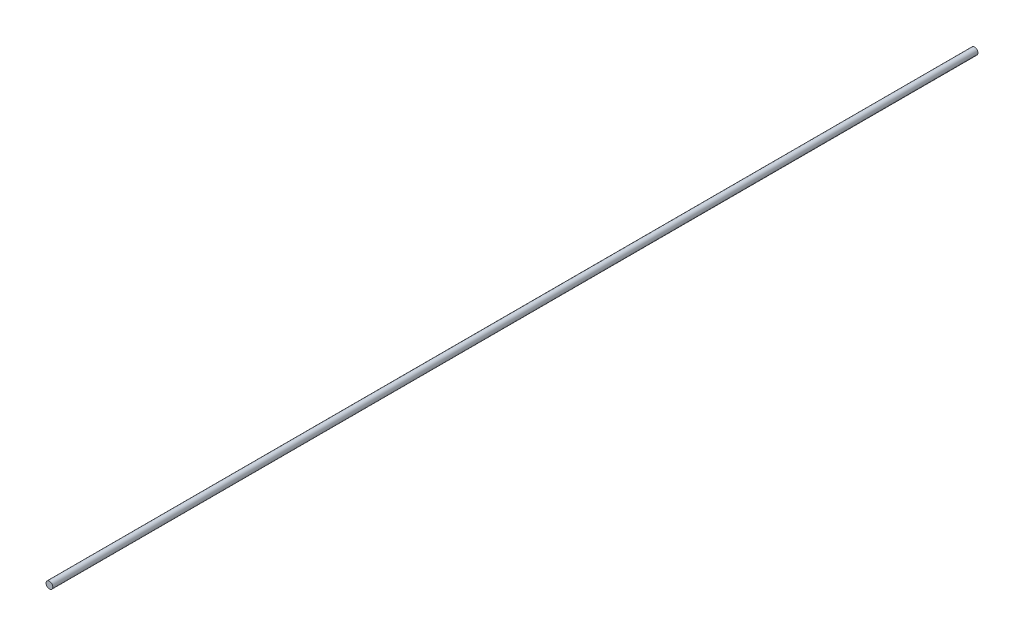
ISO-10303-21;
HEADER;
FILE_DESCRIPTION(('STEP AP214'),'2;1');
FILE_NAME('part.step','',(''),(''),'','','');
FILE_SCHEMA(('AUTOMOTIVE_DESIGN { 1 0 10303 214 1 1 1 1 }'));
ENDSEC;
DATA;
#1=APPLICATION_CONTEXT('core data for automotive mechanical design processes');
#2=APPLICATION_PROTOCOL_DEFINITION('international standard','automotive_design',2000,#1);
#3=PRODUCT_CONTEXT('',#1,'mechanical');
#4=PRODUCT('Part','Part','',(#3));
#5=PRODUCT_RELATED_PRODUCT_CATEGORY('part','',(#4));
#6=PRODUCT_DEFINITION_FORMATION('','',#4);
#7=PRODUCT_DEFINITION_CONTEXT('part definition',#1,'design');
#8=PRODUCT_DEFINITION('design','',#6,#7);
#9=PRODUCT_DEFINITION_SHAPE('','',#8);
#10=(LENGTH_UNIT() NAMED_UNIT(*) SI_UNIT(.MILLI.,.METRE.));
#11=(NAMED_UNIT(*) PLANE_ANGLE_UNIT() SI_UNIT($,.RADIAN.));
#12=(NAMED_UNIT(*) SI_UNIT($,.STERADIAN.) SOLID_ANGLE_UNIT());
#13=UNCERTAINTY_MEASURE_WITH_UNIT(LENGTH_MEASURE(1.E-05),#10,'distance_accuracy_value','');
#14=(GEOMETRIC_REPRESENTATION_CONTEXT(3) GLOBAL_UNCERTAINTY_ASSIGNED_CONTEXT((#13)) GLOBAL_UNIT_ASSIGNED_CONTEXT((#10,
#11,#12)) REPRESENTATION_CONTEXT('',''));
#15=CARTESIAN_POINT('',(0.,0.,0.));
#16=DIRECTION('',(0.,0.,1.));
#17=DIRECTION('',(1.,0.,0.));
#18=AXIS2_PLACEMENT_3D('',#15,#16,#17);
#19=CARTESIAN_POINT('',(0.,0.,863.6));
#20=DIRECTION('',(0.,0.,-1.));
#21=DIRECTION('',(-1.,0.,0.));
#22=AXIS2_PLACEMENT_3D('',#19,#20,#21);
#23=CYLINDRICAL_SURFACE('',#22,6.35);
#24=CARTESIAN_POINT('',(0.,0.,863.6));
#25=DIRECTION('',(0.,0.,1.));
#26=DIRECTION('',(1.,0.,0.));
#27=AXIS2_PLACEMENT_3D('',#24,#25,#26);
#28=CIRCLE('',#27,6.35);
#29=CARTESIAN_POINT('',(6.35,0.,863.6));
#30=VERTEX_POINT('',#29);
#31=EDGE_CURVE('E10',#30,#30,#28,.T.);
#32=ORIENTED_EDGE('',*,*,#31,.F.);
#33=EDGE_LOOP('',(#32));
#34=FACE_BOUND('',#33,.T.);
#35=CARTESIAN_POINT('',(0.,0.,-863.6));
#36=DIRECTION('',(0.,0.,1.));
#37=DIRECTION('',(1.,0.,0.));
#38=AXIS2_PLACEMENT_3D('',#35,#36,#37);
#39=CIRCLE('',#38,6.35);
#40=CARTESIAN_POINT('',(6.35,0.,-863.6));
#41=VERTEX_POINT('',#40);
#42=EDGE_CURVE('E46',#41,#41,#39,.T.);
#43=ORIENTED_EDGE('',*,*,#42,.T.);
#44=EDGE_LOOP('',(#43));
#45=FACE_BOUND('',#44,.T.);
#46=ADVANCED_FACE('F43',(#34,#45),#23,.T.);
#47=CARTESIAN_POINT('',(0.,0.,863.6));
#48=DIRECTION('',(0.,0.,1.));
#49=DIRECTION('',(1.,0.,0.));
#50=AXIS2_PLACEMENT_3D('',#47,#48,#49);
#51=PLANE('',#50);
#52=ORIENTED_EDGE('',*,*,#31,.T.);
#53=EDGE_LOOP('',(#52));
#54=FACE_BOUND('',#53,.T.);
#55=ADVANCED_FACE('F60',(#54),#51,.T.);
#56=CARTESIAN_POINT('',(0.,0.,-863.6));
#57=DIRECTION('',(0.,0.,1.));
#58=DIRECTION('',(1.,0.,0.));
#59=AXIS2_PLACEMENT_3D('',#56,#57,#58);
#60=PLANE('',#59);
#61=ORIENTED_EDGE('',*,*,#42,.F.);
#62=EDGE_LOOP('',(#61));
#63=FACE_BOUND('',#62,.T.);
#64=ADVANCED_FACE('F58',(#63),#60,.F.);
#65=CLOSED_SHELL('',(#46,#55,#64));
#66=MANIFOLD_SOLID_BREP('B2',#65);
#67=ADVANCED_BREP_SHAPE_REPRESENTATION('',(#18,#66),#14);
#68=SHAPE_DEFINITION_REPRESENTATION(#9,#67);
ENDSEC;
END-ISO-10303-21;
